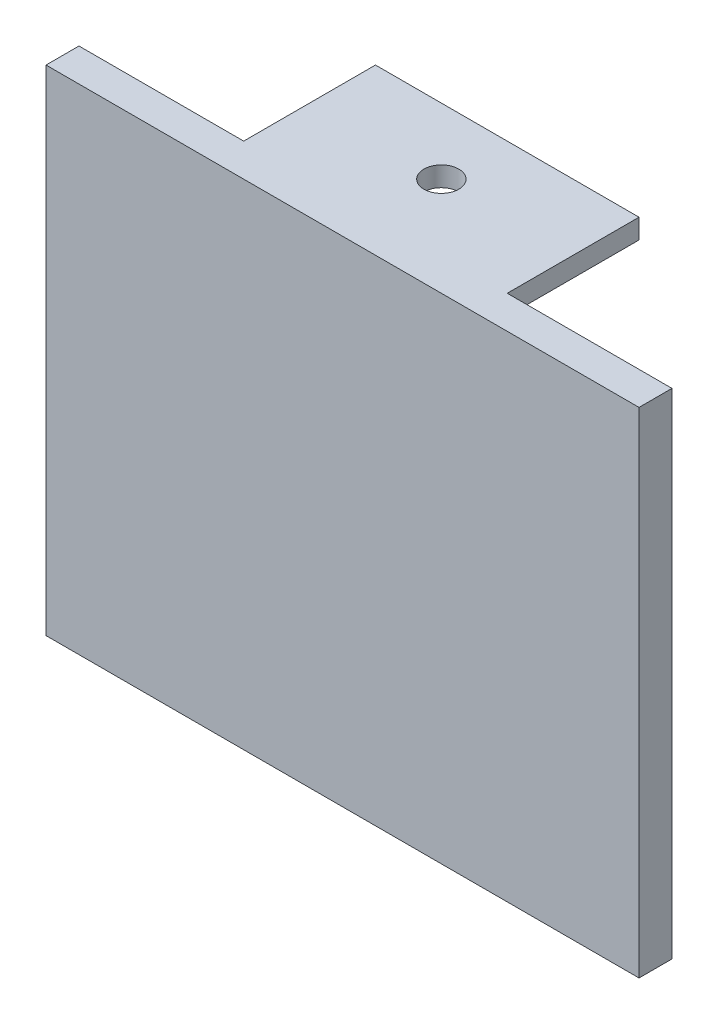
ISO-10303-21;
HEADER;
FILE_DESCRIPTION(('STEP AP214'),'2;1');
FILE_NAME('part.step','',(''),(''),'','','');
FILE_SCHEMA(('AUTOMOTIVE_DESIGN { 1 0 10303 214 1 1 1 1 }'));
ENDSEC;
DATA;
#1=APPLICATION_CONTEXT('core data for automotive mechanical design processes');
#2=APPLICATION_PROTOCOL_DEFINITION('international standard','automotive_design',2000,#1);
#3=PRODUCT_CONTEXT('',#1,'mechanical');
#4=PRODUCT('Part','Part','',(#3));
#5=PRODUCT_RELATED_PRODUCT_CATEGORY('part','',(#4));
#6=PRODUCT_DEFINITION_FORMATION('','',#4);
#7=PRODUCT_DEFINITION_CONTEXT('part definition',#1,'design');
#8=PRODUCT_DEFINITION('design','',#6,#7);
#9=PRODUCT_DEFINITION_SHAPE('','',#8);
#10=(LENGTH_UNIT() NAMED_UNIT(*) SI_UNIT(.MILLI.,.METRE.));
#11=(NAMED_UNIT(*) PLANE_ANGLE_UNIT() SI_UNIT($,.RADIAN.));
#12=(NAMED_UNIT(*) SI_UNIT($,.STERADIAN.) SOLID_ANGLE_UNIT());
#13=UNCERTAINTY_MEASURE_WITH_UNIT(LENGTH_MEASURE(1.E-05),#10,'distance_accuracy_value','');
#14=(GEOMETRIC_REPRESENTATION_CONTEXT(3) GLOBAL_UNCERTAINTY_ASSIGNED_CONTEXT((#13)) GLOBAL_UNIT_ASSIGNED_CONTEXT((#10,
#11,#12)) REPRESENTATION_CONTEXT('',''));
#15=CARTESIAN_POINT('',(0.,0.,0.));
#16=DIRECTION('',(0.,0.,1.));
#17=DIRECTION('',(1.,0.,0.));
#18=AXIS2_PLACEMENT_3D('',#15,#16,#17);
#19=CARTESIAN_POINT('',(0.,0.,0.));
#20=DIRECTION('',(0.,0.,1.));
#21=DIRECTION('',(1.,0.,0.));
#22=AXIS2_PLACEMENT_3D('',#19,#20,#21);
#23=PLANE('',#22);
#24=DIRECTION('',(-1.,0.,0.));
#25=VECTOR('',#24,1.);
#26=CARTESIAN_POINT('',(41.0240383943141,-52.1462556216479,0.));
#27=LINE('',#26,#25);
#28=CARTESIAN_POINT('',(41.0240383943141,-52.1462556216479,0.));
#29=VERTEX_POINT('',#28);
#30=CARTESIAN_POINT('',(-43.9759616056859,-52.1462556216479,0.));
#31=VERTEX_POINT('',#30);
#32=EDGE_CURVE('E156',#29,#31,#27,.T.);
#33=ORIENTED_EDGE('',*,*,#32,.F.);
#34=DIRECTION('',(0.,-1.,0.));
#35=VECTOR('',#34,1.);
#36=CARTESIAN_POINT('',(41.0240383943141,16.8537443783521,0.));
#37=LINE('',#36,#35);
#38=CARTESIAN_POINT('',(41.0240383943141,16.8537443783521,0.));
#39=VERTEX_POINT('',#38);
#40=EDGE_CURVE('E53',#39,#29,#37,.T.);
#41=ORIENTED_EDGE('',*,*,#40,.F.);
#42=DIRECTION('',(1.,0.,0.));
#43=VECTOR('',#42,1.);
#44=CARTESIAN_POINT('',(41.0240383943141,16.8537443783521,0.));
#45=LINE('',#44,#43);
#46=CARTESIAN_POINT('',(-43.9759616056859,16.8537443783521,0.));
#47=VERTEX_POINT('',#46);
#48=EDGE_CURVE('E147',#47,#39,#45,.T.);
#49=ORIENTED_EDGE('',*,*,#48,.F.);
#50=DIRECTION('',(0.,1.,0.));
#51=VECTOR('',#50,1.);
#52=CARTESIAN_POINT('',(-43.9759616056859,16.8537443783521,0.));
#53=LINE('',#52,#51);
#54=EDGE_CURVE('E150',#31,#47,#53,.T.);
#55=ORIENTED_EDGE('',*,*,#54,.F.);
#56=EDGE_LOOP('',(#33,#41,#49,#55));
#57=FACE_BOUND('',#56,.T.);
#58=DIRECTION('',(0.,-1.,0.));
#59=VECTOR('',#58,1.);
#60=CARTESIAN_POINT('',(18.8314176245211,20.9195402298851,0.));
#61=LINE('',#60,#59);
#62=CARTESIAN_POINT('',(18.8314176245211,20.9195402298851,0.));
#63=VERTEX_POINT('',#62);
#64=CARTESIAN_POINT('',(18.8314176245211,17.9195402298851,0.));
#65=VERTEX_POINT('',#64);
#66=EDGE_CURVE('E179',#63,#65,#61,.T.);
#67=ORIENTED_EDGE('',*,*,#66,.F.);
#68=DIRECTION('',(-1.,0.,0.));
#69=VECTOR('',#68,1.);
#70=CARTESIAN_POINT('',(-46.1685823754789,20.9195402298851,0.));
#71=LINE('',#70,#69);
#72=CARTESIAN_POINT('',(43.8314176245211,20.9195402298851,0.));
#73=VERTEX_POINT('',#72);
#74=EDGE_CURVE('E200',#73,#63,#71,.T.);
#75=ORIENTED_EDGE('',*,*,#74,.F.);
#76=DIRECTION('',(0.,1.,0.));
#77=VECTOR('',#76,1.);
#78=CARTESIAN_POINT('',(43.8314176245211,20.9195402298851,0.));
#79=LINE('',#78,#77);
#80=CARTESIAN_POINT('',(43.8314176245211,-54.0804597701149,0.));
#81=VERTEX_POINT('',#80);
#82=EDGE_CURVE('E211',#81,#73,#79,.T.);
#83=ORIENTED_EDGE('',*,*,#82,.F.);
#84=DIRECTION('',(1.,0.,0.));
#85=VECTOR('',#84,1.);
#86=CARTESIAN_POINT('',(-46.1685823754789,-54.0804597701149,0.));
#87=LINE('',#86,#85);
#88=CARTESIAN_POINT('',(-46.1685823754789,-54.0804597701149,0.));
#89=VERTEX_POINT('',#88);
#90=EDGE_CURVE('E209',#89,#81,#87,.T.);
#91=ORIENTED_EDGE('',*,*,#90,.F.);
#92=DIRECTION('',(0.,-1.,0.));
#93=VECTOR('',#92,1.);
#94=CARTESIAN_POINT('',(-46.1685823754789,20.9195402298851,0.));
#95=LINE('',#94,#93);
#96=CARTESIAN_POINT('',(-46.1685823754789,20.9195402298851,0.));
#97=VERTEX_POINT('',#96);
#98=EDGE_CURVE('E195',#97,#89,#95,.T.);
#99=ORIENTED_EDGE('',*,*,#98,.F.);
#100=CARTESIAN_POINT('',(-21.1685823754789,20.9195402298851,0.));
#101=VERTEX_POINT('',#100);
#102=EDGE_CURVE('E213',#101,#97,#71,.T.);
#103=ORIENTED_EDGE('',*,*,#102,.F.);
#104=DIRECTION('',(0.,1.,0.));
#105=VECTOR('',#104,1.);
#106=CARTESIAN_POINT('',(-21.1685823754789,20.9195402298851,0.));
#107=LINE('',#106,#105);
#108=CARTESIAN_POINT('',(-21.1685823754789,17.9195402298851,0.));
#109=VERTEX_POINT('',#108);
#110=EDGE_CURVE('E172',#109,#101,#107,.T.);
#111=ORIENTED_EDGE('',*,*,#110,.F.);
#112=DIRECTION('',(-1.,0.,0.));
#113=VECTOR('',#112,1.);
#114=CARTESIAN_POINT('',(18.8314176245211,17.9195402298851,0.));
#115=LINE('',#114,#113);
#116=EDGE_CURVE('E61',#65,#109,#115,.T.);
#117=ORIENTED_EDGE('',*,*,#116,.F.);
#118=EDGE_LOOP('',(#67,#75,#83,#91,#99,#103,#111,#117));
#119=FACE_BOUND('',#118,.T.);
#120=ADVANCED_FACE('F37',(#57,#119),#23,.F.);
#121=CARTESIAN_POINT('',(-46.1685823754789,20.9195402298851,5.));
#122=DIRECTION('',(1.,0.,0.));
#123=DIRECTION('',(0.,1.,0.));
#124=AXIS2_PLACEMENT_3D('',#121,#122,#123);
#125=PLANE('',#124);
#126=ORIENTED_EDGE('',*,*,#98,.T.);
#127=DIRECTION('',(0.,0.,-1.));
#128=VECTOR('',#127,1.);
#129=CARTESIAN_POINT('',(-46.1685823754789,-54.0804597701149,5.));
#130=LINE('',#129,#128);
#131=CARTESIAN_POINT('',(-46.1685823754789,-54.0804597701149,5.));
#132=VERTEX_POINT('',#131);
#133=EDGE_CURVE('E11',#132,#89,#130,.T.);
#134=ORIENTED_EDGE('',*,*,#133,.F.);
#135=DIRECTION('',(0.,-1.,0.));
#136=VECTOR('',#135,1.);
#137=CARTESIAN_POINT('',(-46.1685823754789,20.9195402298851,5.));
#138=LINE('',#137,#136);
#139=CARTESIAN_POINT('',(-46.1685823754789,20.9195402298851,5.));
#140=VERTEX_POINT('',#139);
#141=EDGE_CURVE('E196',#140,#132,#138,.T.);
#142=ORIENTED_EDGE('',*,*,#141,.F.);
#143=DIRECTION('',(0.,0.,-1.));
#144=VECTOR('',#143,1.);
#145=CARTESIAN_POINT('',(-46.1685823754789,20.9195402298851,5.));
#146=LINE('',#145,#144);
#147=EDGE_CURVE('E206',#140,#97,#146,.T.);
#148=ORIENTED_EDGE('',*,*,#147,.T.);
#149=EDGE_LOOP('',(#126,#134,#142,#148));
#150=FACE_BOUND('',#149,.T.);
#151=ADVANCED_FACE('F39',(#150),#125,.F.);
#152=CARTESIAN_POINT('',(-46.1685823754789,-54.0804597701149,5.));
#153=DIRECTION('',(0.,1.,0.));
#154=DIRECTION('',(0.,0.,1.));
#155=AXIS2_PLACEMENT_3D('',#152,#153,#154);
#156=PLANE('',#155);
#157=ORIENTED_EDGE('',*,*,#90,.T.);
#158=DIRECTION('',(0.,0.,-1.));
#159=VECTOR('',#158,1.);
#160=CARTESIAN_POINT('',(43.8314176245211,-54.0804597701149,5.));
#161=LINE('',#160,#159);
#162=CARTESIAN_POINT('',(43.8314176245211,-54.0804597701149,5.));
#163=VERTEX_POINT('',#162);
#164=EDGE_CURVE('E46',#163,#81,#161,.T.);
#165=ORIENTED_EDGE('',*,*,#164,.F.);
#166=DIRECTION('',(1.,0.,0.));
#167=VECTOR('',#166,1.);
#168=CARTESIAN_POINT('',(-46.1685823754789,-54.0804597701149,5.));
#169=LINE('',#168,#167);
#170=EDGE_CURVE('E199',#132,#163,#169,.T.);
#171=ORIENTED_EDGE('',*,*,#170,.F.);
#172=ORIENTED_EDGE('',*,*,#133,.T.);
#173=EDGE_LOOP('',(#157,#165,#171,#172));
#174=FACE_BOUND('',#173,.T.);
#175=ADVANCED_FACE('F270',(#174),#156,.F.);
#176=CARTESIAN_POINT('',(43.8314176245211,20.9195402298851,5.));
#177=DIRECTION('',(-1.,0.,0.));
#178=DIRECTION('',(0.,0.,1.));
#179=AXIS2_PLACEMENT_3D('',#176,#177,#178);
#180=PLANE('',#179);
#181=ORIENTED_EDGE('',*,*,#82,.T.);
#182=DIRECTION('',(0.,0.,-1.));
#183=VECTOR('',#182,1.);
#184=CARTESIAN_POINT('',(43.8314176245211,20.9195402298851,5.));
#185=LINE('',#184,#183);
#186=CARTESIAN_POINT('',(43.8314176245211,20.9195402298851,5.));
#187=VERTEX_POINT('',#186);
#188=EDGE_CURVE('E218',#187,#73,#185,.T.);
#189=ORIENTED_EDGE('',*,*,#188,.F.);
#190=DIRECTION('',(0.,1.,0.));
#191=VECTOR('',#190,1.);
#192=CARTESIAN_POINT('',(43.8314176245211,20.9195402298851,5.));
#193=LINE('',#192,#191);
#194=EDGE_CURVE('E202',#163,#187,#193,.T.);
#195=ORIENTED_EDGE('',*,*,#194,.F.);
#196=ORIENTED_EDGE('',*,*,#164,.T.);
#197=EDGE_LOOP('',(#181,#189,#195,#196));
#198=FACE_BOUND('',#197,.T.);
#199=ADVANCED_FACE('F226',(#198),#180,.F.);
#200=CARTESIAN_POINT('',(-46.1685823754789,20.9195402298851,5.));
#201=DIRECTION('',(0.,-1.,0.));
#202=DIRECTION('',(0.,0.,-1.));
#203=AXIS2_PLACEMENT_3D('',#200,#201,#202);
#204=PLANE('',#203);
#205=CARTESIAN_POINT('',(-1.16858237547892,20.9195402298851,-10.));
#206=DIRECTION('',(0.,1.,0.));
#207=DIRECTION('',(0.,0.,1.));
#208=AXIS2_PLACEMENT_3D('',#205,#206,#207);
#209=CIRCLE('',#208,2.65);
#210=CARTESIAN_POINT('',(-1.16858237547892,20.9195402298851,-7.35));
#211=VERTEX_POINT('',#210);
#212=EDGE_CURVE('E162',#211,#211,#209,.T.);
#213=ORIENTED_EDGE('',*,*,#212,.F.);
#214=EDGE_LOOP('',(#213));
#215=FACE_BOUND('',#214,.T.);
#216=ORIENTED_EDGE('',*,*,#74,.T.);
#217=DIRECTION('',(0.,0.,1.));
#218=VECTOR('',#217,1.);
#219=CARTESIAN_POINT('',(18.8314176245211,20.9195402298851,-20.));
#220=LINE('',#219,#218);
#221=CARTESIAN_POINT('',(18.8314176245211,20.9195402298851,-20.));
#222=VERTEX_POINT('',#221);
#223=EDGE_CURVE('E178',#222,#63,#220,.T.);
#224=ORIENTED_EDGE('',*,*,#223,.F.);
#225=DIRECTION('',(1.,0.,0.));
#226=VECTOR('',#225,1.);
#227=CARTESIAN_POINT('',(18.8314176245211,20.9195402298851,-20.));
#228=LINE('',#227,#226);
#229=CARTESIAN_POINT('',(-21.1685823754789,20.9195402298851,-20.));
#230=VERTEX_POINT('',#229);
#231=EDGE_CURVE('E176',#230,#222,#228,.T.);
#232=ORIENTED_EDGE('',*,*,#231,.F.);
#233=DIRECTION('',(0.,0.,1.));
#234=VECTOR('',#233,1.);
#235=CARTESIAN_POINT('',(-21.1685823754789,20.9195402298851,-20.));
#236=LINE('',#235,#234);
#237=EDGE_CURVE('E187',#230,#101,#236,.T.);
#238=ORIENTED_EDGE('',*,*,#237,.T.);
#239=ORIENTED_EDGE('',*,*,#102,.T.);
#240=ORIENTED_EDGE('',*,*,#147,.F.);
#241=DIRECTION('',(-1.,0.,0.));
#242=VECTOR('',#241,1.);
#243=CARTESIAN_POINT('',(-46.1685823754789,20.9195402298851,5.));
#244=LINE('',#243,#242);
#245=EDGE_CURVE('E204',#187,#140,#244,.T.);
#246=ORIENTED_EDGE('',*,*,#245,.F.);
#247=ORIENTED_EDGE('',*,*,#188,.T.);
#248=EDGE_LOOP('',(#216,#224,#232,#238,#239,#240,#246,#247));
#249=FACE_BOUND('',#248,.T.);
#250=ADVANCED_FACE('F233',(#215,#249),#204,.F.);
#251=CARTESIAN_POINT('',(0.,0.,5.));
#252=DIRECTION('',(0.,0.,1.));
#253=DIRECTION('',(1.,0.,0.));
#254=AXIS2_PLACEMENT_3D('',#251,#252,#253);
#255=PLANE('',#254);
#256=ORIENTED_EDGE('',*,*,#141,.T.);
#257=ORIENTED_EDGE('',*,*,#170,.T.);
#258=ORIENTED_EDGE('',*,*,#194,.T.);
#259=ORIENTED_EDGE('',*,*,#245,.T.);
#260=EDGE_LOOP('',(#256,#257,#258,#259));
#261=FACE_BOUND('',#260,.T.);
#262=ADVANCED_FACE('F260',(#261),#255,.T.);
#263=CARTESIAN_POINT('',(18.8314176245211,20.9195402298851,-20.));
#264=DIRECTION('',(-1.,0.,0.));
#265=DIRECTION('',(0.,0.,1.));
#266=AXIS2_PLACEMENT_3D('',#263,#264,#265);
#267=PLANE('',#266);
#268=ORIENTED_EDGE('',*,*,#66,.T.);
#269=DIRECTION('',(0.,0.,1.));
#270=VECTOR('',#269,1.);
#271=CARTESIAN_POINT('',(18.8314176245211,17.9195402298851,-20.));
#272=LINE('',#271,#270);
#273=CARTESIAN_POINT('',(18.8314176245211,17.9195402298851,-20.));
#274=VERTEX_POINT('',#273);
#275=EDGE_CURVE('E193',#274,#65,#272,.T.);
#276=ORIENTED_EDGE('',*,*,#275,.F.);
#277=DIRECTION('',(0.,-1.,0.));
#278=VECTOR('',#277,1.);
#279=CARTESIAN_POINT('',(18.8314176245211,20.9195402298851,-20.));
#280=LINE('',#279,#278);
#281=EDGE_CURVE('E168',#222,#274,#280,.T.);
#282=ORIENTED_EDGE('',*,*,#281,.F.);
#283=ORIENTED_EDGE('',*,*,#223,.T.);
#284=EDGE_LOOP('',(#268,#276,#282,#283));
#285=FACE_BOUND('',#284,.T.);
#286=ADVANCED_FACE('F238',(#285),#267,.F.);
#287=CARTESIAN_POINT('',(18.8314176245211,17.9195402298851,-20.));
#288=DIRECTION('',(0.,1.,0.));
#289=DIRECTION('',(0.,0.,1.));
#290=AXIS2_PLACEMENT_3D('',#287,#288,#289);
#291=PLANE('',#290);
#292=CARTESIAN_POINT('',(-1.16858237547892,17.9195402298851,-10.));
#293=DIRECTION('',(0.,1.,0.));
#294=DIRECTION('',(0.,0.,1.));
#295=AXIS2_PLACEMENT_3D('',#292,#293,#294);
#296=CIRCLE('',#295,2.65);
#297=CARTESIAN_POINT('',(-1.16858237547892,17.9195402298851,-7.35));
#298=VERTEX_POINT('',#297);
#299=EDGE_CURVE('E41',#298,#298,#296,.T.);
#300=ORIENTED_EDGE('',*,*,#299,.T.);
#301=EDGE_LOOP('',(#300));
#302=FACE_BOUND('',#301,.T.);
#303=ORIENTED_EDGE('',*,*,#116,.T.);
#304=DIRECTION('',(0.,0.,1.));
#305=VECTOR('',#304,1.);
#306=CARTESIAN_POINT('',(-21.1685823754789,17.9195402298851,-20.));
#307=LINE('',#306,#305);
#308=CARTESIAN_POINT('',(-21.1685823754789,17.9195402298851,-20.));
#309=VERTEX_POINT('',#308);
#310=EDGE_CURVE('E190',#309,#109,#307,.T.);
#311=ORIENTED_EDGE('',*,*,#310,.F.);
#312=DIRECTION('',(-1.,0.,0.));
#313=VECTOR('',#312,1.);
#314=CARTESIAN_POINT('',(18.8314176245211,17.9195402298851,-20.));
#315=LINE('',#314,#313);
#316=EDGE_CURVE('E171',#274,#309,#315,.T.);
#317=ORIENTED_EDGE('',*,*,#316,.F.);
#318=ORIENTED_EDGE('',*,*,#275,.T.);
#319=EDGE_LOOP('',(#303,#311,#317,#318));
#320=FACE_BOUND('',#319,.T.);
#321=ADVANCED_FACE('F249',(#302,#320),#291,.F.);
#322=CARTESIAN_POINT('',(-21.1685823754789,20.9195402298851,-20.));
#323=DIRECTION('',(1.,0.,0.));
#324=DIRECTION('',(0.,0.,-1.));
#325=AXIS2_PLACEMENT_3D('',#322,#323,#324);
#326=PLANE('',#325);
#327=ORIENTED_EDGE('',*,*,#110,.T.);
#328=ORIENTED_EDGE('',*,*,#237,.F.);
#329=DIRECTION('',(0.,1.,0.));
#330=VECTOR('',#329,1.);
#331=CARTESIAN_POINT('',(-21.1685823754789,20.9195402298851,-20.));
#332=LINE('',#331,#330);
#333=EDGE_CURVE('E174',#309,#230,#332,.T.);
#334=ORIENTED_EDGE('',*,*,#333,.F.);
#335=ORIENTED_EDGE('',*,*,#310,.T.);
#336=EDGE_LOOP('',(#327,#328,#334,#335));
#337=FACE_BOUND('',#336,.T.);
#338=ADVANCED_FACE('F247',(#337),#326,.F.);
#339=CARTESIAN_POINT('',(0.,0.,-20.));
#340=DIRECTION('',(0.,0.,-1.));
#341=DIRECTION('',(-1.,0.,0.));
#342=AXIS2_PLACEMENT_3D('',#339,#340,#341);
#343=PLANE('',#342);
#344=ORIENTED_EDGE('',*,*,#281,.T.);
#345=ORIENTED_EDGE('',*,*,#316,.T.);
#346=ORIENTED_EDGE('',*,*,#333,.T.);
#347=ORIENTED_EDGE('',*,*,#231,.T.);
#348=EDGE_LOOP('',(#344,#345,#346,#347));
#349=FACE_BOUND('',#348,.T.);
#350=ADVANCED_FACE('F241',(#349),#343,.T.);
#351=CARTESIAN_POINT('',(-1.16858237547892,0.919540229885059,-10.));
#352=DIRECTION('',(0.,1.,0.));
#353=DIRECTION('',(0.,0.,1.));
#354=AXIS2_PLACEMENT_3D('',#351,#352,#353);
#355=CYLINDRICAL_SURFACE('',#354,2.65);
#356=ORIENTED_EDGE('',*,*,#212,.T.);
#357=EDGE_LOOP('',(#356));
#358=FACE_BOUND('',#357,.T.);
#359=ORIENTED_EDGE('',*,*,#299,.F.);
#360=EDGE_LOOP('',(#359));
#361=FACE_BOUND('',#360,.T.);
#362=ADVANCED_FACE('F303',(#358,#361),#355,.F.);
#363=CARTESIAN_POINT('',(41.0240383943141,16.8537443783521,3.));
#364=DIRECTION('',(1.,0.,0.));
#365=DIRECTION('',(0.,1.,0.));
#366=AXIS2_PLACEMENT_3D('',#363,#364,#365);
#367=PLANE('',#366);
#368=ORIENTED_EDGE('',*,*,#40,.T.);
#369=DIRECTION('',(0.,0.,-1.));
#370=VECTOR('',#369,1.);
#371=CARTESIAN_POINT('',(41.0240383943141,-52.1462556216479,3.));
#372=LINE('',#371,#370);
#373=CARTESIAN_POINT('',(41.0240383943141,-52.1462556216479,3.));
#374=VERTEX_POINT('',#373);
#375=EDGE_CURVE('E125',#374,#29,#372,.T.);
#376=ORIENTED_EDGE('',*,*,#375,.F.);
#377=DIRECTION('',(0.,-1.,0.));
#378=VECTOR('',#377,1.);
#379=CARTESIAN_POINT('',(41.0240383943141,16.8537443783521,3.));
#380=LINE('',#379,#378);
#381=CARTESIAN_POINT('',(41.0240383943141,16.8537443783521,3.));
#382=VERTEX_POINT('',#381);
#383=EDGE_CURVE('E129',#382,#374,#380,.T.);
#384=ORIENTED_EDGE('',*,*,#383,.F.);
#385=DIRECTION('',(0.,0.,-1.));
#386=VECTOR('',#385,1.);
#387=CARTESIAN_POINT('',(41.0240383943141,16.8537443783521,3.));
#388=LINE('',#387,#386);
#389=EDGE_CURVE('E160',#382,#39,#388,.T.);
#390=ORIENTED_EDGE('',*,*,#389,.T.);
#391=EDGE_LOOP('',(#368,#376,#384,#390));
#392=FACE_BOUND('',#391,.T.);
#393=ADVANCED_FACE('F127',(#392),#367,.F.);
#394=CARTESIAN_POINT('',(41.0240383943141,16.8537443783521,3.));
#395=DIRECTION('',(0.,1.,0.));
#396=DIRECTION('',(0.,0.,1.));
#397=AXIS2_PLACEMENT_3D('',#394,#395,#396);
#398=PLANE('',#397);
#399=ORIENTED_EDGE('',*,*,#48,.T.);
#400=ORIENTED_EDGE('',*,*,#389,.F.);
#401=DIRECTION('',(1.,0.,0.));
#402=VECTOR('',#401,1.);
#403=CARTESIAN_POINT('',(41.0240383943141,16.8537443783521,3.));
#404=LINE('',#403,#402);
#405=CARTESIAN_POINT('',(-43.9759616056859,16.8537443783521,3.));
#406=VERTEX_POINT('',#405);
#407=EDGE_CURVE('E135',#406,#382,#404,.T.);
#408=ORIENTED_EDGE('',*,*,#407,.F.);
#409=DIRECTION('',(0.,0.,-1.));
#410=VECTOR('',#409,1.);
#411=CARTESIAN_POINT('',(-43.9759616056859,16.8537443783521,3.));
#412=LINE('',#411,#410);
#413=EDGE_CURVE('E163',#406,#47,#412,.T.);
#414=ORIENTED_EDGE('',*,*,#413,.T.);
#415=EDGE_LOOP('',(#399,#400,#408,#414));
#416=FACE_BOUND('',#415,.T.);
#417=ADVANCED_FACE('F332',(#416),#398,.F.);
#418=CARTESIAN_POINT('',(-43.9759616056859,16.8537443783521,3.));
#419=DIRECTION('',(-1.,0.,0.));
#420=DIRECTION('',(0.,-1.,0.));
#421=AXIS2_PLACEMENT_3D('',#418,#419,#420);
#422=PLANE('',#421);
#423=ORIENTED_EDGE('',*,*,#54,.T.);
#424=ORIENTED_EDGE('',*,*,#413,.F.);
#425=DIRECTION('',(0.,1.,0.));
#426=VECTOR('',#425,1.);
#427=CARTESIAN_POINT('',(-43.9759616056859,16.8537443783521,3.));
#428=LINE('',#427,#426);
#429=CARTESIAN_POINT('',(-43.9759616056859,-52.1462556216479,3.));
#430=VERTEX_POINT('',#429);
#431=EDGE_CURVE('E143',#430,#406,#428,.T.);
#432=ORIENTED_EDGE('',*,*,#431,.F.);
#433=DIRECTION('',(0.,0.,-1.));
#434=VECTOR('',#433,1.);
#435=CARTESIAN_POINT('',(-43.9759616056859,-52.1462556216479,3.));
#436=LINE('',#435,#434);
#437=EDGE_CURVE('E134',#430,#31,#436,.T.);
#438=ORIENTED_EDGE('',*,*,#437,.T.);
#439=EDGE_LOOP('',(#423,#424,#432,#438));
#440=FACE_BOUND('',#439,.T.);
#441=ADVANCED_FACE('F339',(#440),#422,.F.);
#442=CARTESIAN_POINT('',(41.0240383943141,-52.1462556216479,3.));
#443=DIRECTION('',(0.,-1.,0.));
#444=DIRECTION('',(0.,0.,-1.));
#445=AXIS2_PLACEMENT_3D('',#442,#443,#444);
#446=PLANE('',#445);
#447=ORIENTED_EDGE('',*,*,#32,.T.);
#448=ORIENTED_EDGE('',*,*,#437,.F.);
#449=DIRECTION('',(-1.,0.,0.));
#450=VECTOR('',#449,1.);
#451=CARTESIAN_POINT('',(41.0240383943141,-52.1462556216479,3.));
#452=LINE('',#451,#450);
#453=EDGE_CURVE('E138',#374,#430,#452,.T.);
#454=ORIENTED_EDGE('',*,*,#453,.F.);
#455=ORIENTED_EDGE('',*,*,#375,.T.);
#456=EDGE_LOOP('',(#447,#448,#454,#455));
#457=FACE_BOUND('',#456,.T.);
#458=ADVANCED_FACE('F139',(#457),#446,.F.);
#459=CARTESIAN_POINT('',(0.,0.,3.));
#460=DIRECTION('',(0.,0.,-1.));
#461=DIRECTION('',(-1.,0.,0.));
#462=AXIS2_PLACEMENT_3D('',#459,#460,#461);
#463=PLANE('',#462);
#464=ORIENTED_EDGE('',*,*,#383,.T.);
#465=ORIENTED_EDGE('',*,*,#453,.T.);
#466=ORIENTED_EDGE('',*,*,#431,.T.);
#467=ORIENTED_EDGE('',*,*,#407,.T.);
#468=EDGE_LOOP('',(#464,#465,#466,#467));
#469=FACE_BOUND('',#468,.T.);
#470=ADVANCED_FACE('F145',(#469),#463,.T.);
#471=CLOSED_SHELL('',(#120,#151,#175,#199,#250,#262,#286,#321,#338,#350,#362,#393,#417,#441,
#458,#470));
#472=MANIFOLD_SOLID_BREP('B2',#471);
#473=ADVANCED_BREP_SHAPE_REPRESENTATION('',(#18,#472),#14);
#474=SHAPE_DEFINITION_REPRESENTATION(#9,#473);
ENDSEC;
END-ISO-10303-21;
